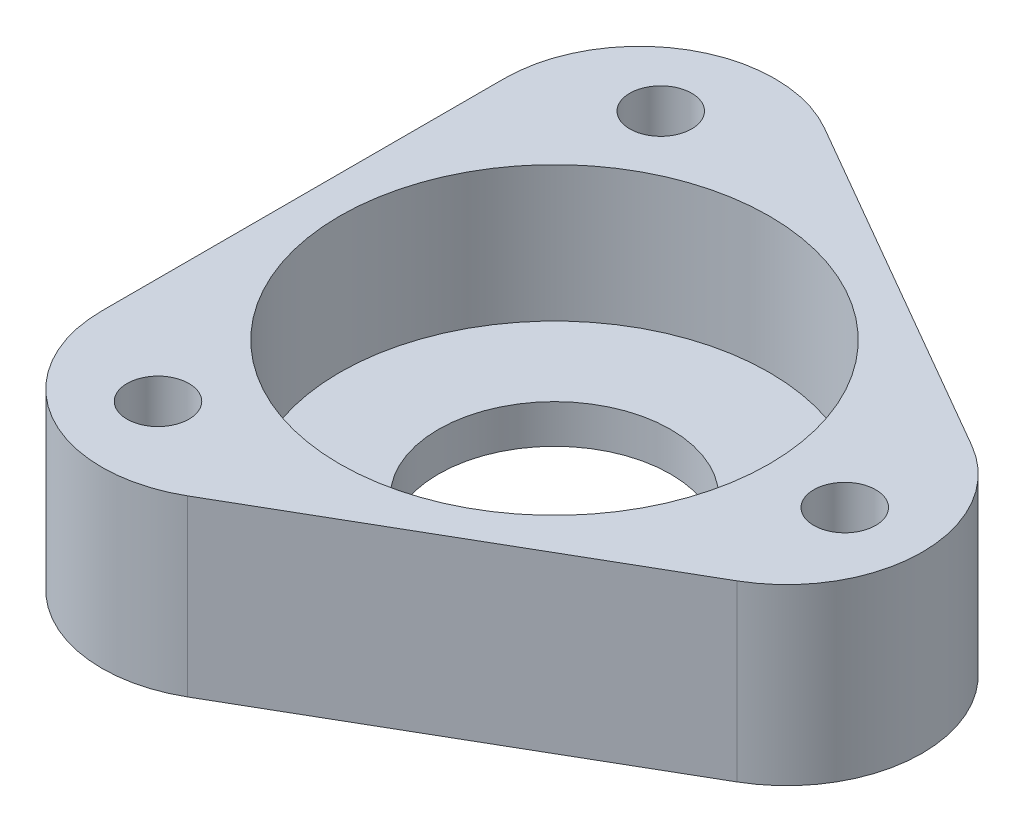
ISO-10303-21;
HEADER;
FILE_DESCRIPTION(('STEP AP214'),'2;1');
FILE_NAME('part.step','',(''),(''),'','','');
FILE_SCHEMA(('AUTOMOTIVE_DESIGN { 1 0 10303 214 1 1 1 1 }'));
ENDSEC;
DATA;
#1=APPLICATION_CONTEXT('core data for automotive mechanical design processes');
#2=APPLICATION_PROTOCOL_DEFINITION('international standard','automotive_design',2000,#1);
#3=PRODUCT_CONTEXT('',#1,'mechanical');
#4=PRODUCT('Part','Part','',(#3));
#5=PRODUCT_RELATED_PRODUCT_CATEGORY('part','',(#4));
#6=PRODUCT_DEFINITION_FORMATION('','',#4);
#7=PRODUCT_DEFINITION_CONTEXT('part definition',#1,'design');
#8=PRODUCT_DEFINITION('design','',#6,#7);
#9=PRODUCT_DEFINITION_SHAPE('','',#8);
#10=(LENGTH_UNIT() NAMED_UNIT(*) SI_UNIT(.MILLI.,.METRE.));
#11=(NAMED_UNIT(*) PLANE_ANGLE_UNIT() SI_UNIT($,.RADIAN.));
#12=(NAMED_UNIT(*) SI_UNIT($,.STERADIAN.) SOLID_ANGLE_UNIT());
#13=UNCERTAINTY_MEASURE_WITH_UNIT(LENGTH_MEASURE(1.E-05),#10,'distance_accuracy_value','');
#14=(GEOMETRIC_REPRESENTATION_CONTEXT(3) GLOBAL_UNCERTAINTY_ASSIGNED_CONTEXT((#13)) GLOBAL_UNIT_ASSIGNED_CONTEXT((#10,
#11,#12)) REPRESENTATION_CONTEXT('',''));
#15=CARTESIAN_POINT('',(0.,0.,0.));
#16=DIRECTION('',(0.,0.,1.));
#17=DIRECTION('',(1.,0.,0.));
#18=AXIS2_PLACEMENT_3D('',#15,#16,#17);
#19=CARTESIAN_POINT('',(0.,8.99999999999995,0.));
#20=DIRECTION('',(0.,1.,0.));
#21=DIRECTION('',(0.,0.,1.));
#22=AXIS2_PLACEMENT_3D('',#19,#20,#21);
#23=PLANE('',#22);
#24=CARTESIAN_POINT('',(0.,8.99999999999995,0.));
#25=DIRECTION('',(0.,1.,0.));
#26=DIRECTION('',(0.,0.,1.));
#27=AXIS2_PLACEMENT_3D('',#24,#25,#26);
#28=CIRCLE('',#27,11.1);
#29=CARTESIAN_POINT('',(0.,8.99999999999995,11.1));
#30=VERTEX_POINT('',#29);
#31=EDGE_CURVE('E175',#30,#30,#28,.T.);
#32=ORIENTED_EDGE('',*,*,#31,.F.);
#33=EDGE_LOOP('',(#32));
#34=FACE_BOUND('',#33,.T.);
#35=CARTESIAN_POINT('',(15.0000000000006,9.00000000000001,-9.57567358739198E-13));
#36=DIRECTION('',(0.,1.,0.));
#37=DIRECTION('',(0.,0.,1.));
#38=AXIS2_PLACEMENT_3D('',#35,#36,#37);
#39=CIRCLE('',#38,1.6);
#40=CARTESIAN_POINT('',(15.0000000000006,9.00000000000001,1.59999999999904));
#41=VERTEX_POINT('',#40);
#42=EDGE_CURVE('E169',#41,#41,#39,.T.);
#43=ORIENTED_EDGE('',*,*,#42,.F.);
#44=EDGE_LOOP('',(#43));
#45=FACE_BOUND('',#44,.T.);
#46=DIRECTION('',(0.866025403784439,0.,-0.5));
#47=VECTOR('',#46,1.);
#48=CARTESIAN_POINT('',(-13.,9.00000000000001,22.5166604983954));
#49=LINE('',#48,#47);
#50=CARTESIAN_POINT('',(-2.50000000000001,9.00000000000006,16.4544826719043));
#51=VERTEX_POINT('',#50);
#52=CARTESIAN_POINT('',(15.5,9.00000000000006,6.06217782649108));
#53=VERTEX_POINT('',#52);
#54=EDGE_CURVE('E120',#51,#53,#49,.T.);
#55=ORIENTED_EDGE('',*,*,#54,.T.);
#56=CARTESIAN_POINT('',(12.,9.00000000000006,0.));
#57=DIRECTION('',(0.,1.,0.));
#58=DIRECTION('',(0.,0.,1.));
#59=AXIS2_PLACEMENT_3D('',#56,#57,#58);
#60=CIRCLE('',#59,7.);
#61=CARTESIAN_POINT('',(15.5,9.00000000000001,-6.06217782649107));
#62=VERTEX_POINT('',#61);
#63=EDGE_CURVE('E136',#53,#62,#60,.T.);
#64=ORIENTED_EDGE('',*,*,#63,.T.);
#65=DIRECTION('',(-0.866025403784439,0.,-0.5));
#66=VECTOR('',#65,1.);
#67=CARTESIAN_POINT('',(26.,9.00000000000006,0.));
#68=LINE('',#67,#66);
#69=CARTESIAN_POINT('',(-2.5,9.00000000000001,-16.4544826719043));
#70=VERTEX_POINT('',#69);
#71=EDGE_CURVE('E110',#62,#70,#68,.T.);
#72=ORIENTED_EDGE('',*,*,#71,.T.);
#73=CARTESIAN_POINT('',(-6.,9.00000000000001,-10.3923048454133));
#74=DIRECTION('',(0.,1.,0.));
#75=DIRECTION('',(0.,0.,1.));
#76=AXIS2_PLACEMENT_3D('',#73,#74,#75);
#77=CIRCLE('',#76,7.);
#78=CARTESIAN_POINT('',(-13.,9.00000000000001,-10.3923048454133));
#79=VERTEX_POINT('',#78);
#80=EDGE_CURVE('E58',#70,#79,#77,.T.);
#81=ORIENTED_EDGE('',*,*,#80,.T.);
#82=DIRECTION('',(0.,0.,1.));
#83=VECTOR('',#82,1.);
#84=CARTESIAN_POINT('',(-13.,9.00000000000001,-22.5166604983954));
#85=LINE('',#84,#83);
#86=CARTESIAN_POINT('',(-13.,9.00000000000012,10.3923048454133));
#87=VERTEX_POINT('',#86);
#88=EDGE_CURVE('E126',#79,#87,#85,.T.);
#89=ORIENTED_EDGE('',*,*,#88,.T.);
#90=CARTESIAN_POINT('',(-6.00000000000001,9.00000000000006,10.3923048454133));
#91=DIRECTION('',(0.,1.,0.));
#92=DIRECTION('',(0.,0.,1.));
#93=AXIS2_PLACEMENT_3D('',#90,#91,#92);
#94=CIRCLE('',#93,7.);
#95=EDGE_CURVE('E134',#87,#51,#94,.T.);
#96=ORIENTED_EDGE('',*,*,#95,.T.);
#97=EDGE_LOOP('',(#55,#64,#72,#81,#89,#96));
#98=FACE_BOUND('',#97,.T.);
#99=CARTESIAN_POINT('',(-7.5,9.00000000000001,-12.9903810567666));
#100=DIRECTION('',(0.,1.,0.));
#101=DIRECTION('',(0.,0.,1.));
#102=AXIS2_PLACEMENT_3D('',#99,#100,#101);
#103=CIRCLE('',#102,1.6);
#104=CARTESIAN_POINT('',(-7.5,9.00000000000001,-11.3903810567666));
#105=VERTEX_POINT('',#104);
#106=EDGE_CURVE('E122',#105,#105,#103,.T.);
#107=ORIENTED_EDGE('',*,*,#106,.F.);
#108=EDGE_LOOP('',(#107));
#109=FACE_BOUND('',#108,.T.);
#110=CARTESIAN_POINT('',(-7.49999999999891,8.99999999999995,12.9903810567666));
#111=DIRECTION('',(0.,1.,0.));
#112=DIRECTION('',(0.,0.,1.));
#113=AXIS2_PLACEMENT_3D('',#110,#111,#112);
#114=CIRCLE('',#113,1.6);
#115=CARTESIAN_POINT('',(-7.49999999999891,8.99999999999995,14.5903810567666));
#116=VERTEX_POINT('',#115);
#117=EDGE_CURVE('E163',#116,#116,#114,.T.);
#118=ORIENTED_EDGE('',*,*,#117,.F.);
#119=EDGE_LOOP('',(#118));
#120=FACE_BOUND('',#119,.T.);
#121=ADVANCED_FACE('F38',(#34,#45,#98,#109,#120),#23,.T.);
#122=CARTESIAN_POINT('',(0.,0.,0.));
#123=DIRECTION('',(0.,1.,0.));
#124=DIRECTION('',(0.,0.,1.));
#125=AXIS2_PLACEMENT_3D('',#122,#123,#124);
#126=PLANE('',#125);
#127=CARTESIAN_POINT('',(0.,0.,0.));
#128=DIRECTION('',(0.,1.,0.));
#129=DIRECTION('',(0.,0.,1.));
#130=AXIS2_PLACEMENT_3D('',#127,#128,#129);
#131=CIRCLE('',#130,6.);
#132=CARTESIAN_POINT('',(0.,0.,6.));
#133=VERTEX_POINT('',#132);
#134=EDGE_CURVE('E285',#133,#133,#131,.T.);
#135=ORIENTED_EDGE('',*,*,#134,.T.);
#136=EDGE_LOOP('',(#135));
#137=FACE_BOUND('',#136,.T.);
#138=DIRECTION('',(-0.866025403784439,0.,-0.5));
#139=VECTOR('',#138,1.);
#140=CARTESIAN_POINT('',(26.,0.,0.));
#141=LINE('',#140,#139);
#142=CARTESIAN_POINT('',(15.5,0.,-6.06217782649107));
#143=VERTEX_POINT('',#142);
#144=CARTESIAN_POINT('',(-2.5,0.,-16.4544826719043));
#145=VERTEX_POINT('',#144);
#146=EDGE_CURVE('E108',#143,#145,#141,.T.);
#147=ORIENTED_EDGE('',*,*,#146,.F.);
#148=CARTESIAN_POINT('',(12.,0.,0.));
#149=DIRECTION('',(0.,1.,0.));
#150=DIRECTION('',(0.,0.,1.));
#151=AXIS2_PLACEMENT_3D('',#148,#149,#150);
#152=CIRCLE('',#151,7.);
#153=CARTESIAN_POINT('',(15.5,0.,6.06217782649108));
#154=VERTEX_POINT('',#153);
#155=EDGE_CURVE('E91',#143,#154,#152,.F.);
#156=ORIENTED_EDGE('',*,*,#155,.T.);
#157=DIRECTION('',(0.866025403784439,0.,-0.5));
#158=VECTOR('',#157,1.);
#159=CARTESIAN_POINT('',(-13.,1.11022302462516E-13,22.5166604983954));
#160=LINE('',#159,#158);
#161=CARTESIAN_POINT('',(-2.50000000000001,0.,16.4544826719043));
#162=VERTEX_POINT('',#161);
#163=EDGE_CURVE('E118',#162,#154,#160,.T.);
#164=ORIENTED_EDGE('',*,*,#163,.F.);
#165=CARTESIAN_POINT('',(-6.,0.,10.3923048454133));
#166=DIRECTION('',(0.,1.,0.));
#167=DIRECTION('',(0.,0.,1.));
#168=AXIS2_PLACEMENT_3D('',#165,#166,#167);
#169=CIRCLE('',#168,7.);
#170=CARTESIAN_POINT('',(-13.,0.,10.3923048454133));
#171=VERTEX_POINT('',#170);
#172=EDGE_CURVE('E102',#162,#171,#169,.F.);
#173=ORIENTED_EDGE('',*,*,#172,.T.);
#174=DIRECTION('',(0.,0.,1.));
#175=VECTOR('',#174,1.);
#176=CARTESIAN_POINT('',(-13.,0.,-22.5166604983954));
#177=LINE('',#176,#175);
#178=CARTESIAN_POINT('',(-13.,0.,-10.3923048454133));
#179=VERTEX_POINT('',#178);
#180=EDGE_CURVE('E117',#179,#171,#177,.T.);
#181=ORIENTED_EDGE('',*,*,#180,.F.);
#182=CARTESIAN_POINT('',(-6.,0.,-10.3923048454133));
#183=DIRECTION('',(0.,1.,0.));
#184=DIRECTION('',(0.,0.,1.));
#185=AXIS2_PLACEMENT_3D('',#182,#183,#184);
#186=CIRCLE('',#185,7.);
#187=EDGE_CURVE('E111',#179,#145,#186,.F.);
#188=ORIENTED_EDGE('',*,*,#187,.T.);
#189=EDGE_LOOP('',(#147,#156,#164,#173,#181,#188));
#190=FACE_BOUND('',#189,.T.);
#191=CARTESIAN_POINT('',(-7.5,0.,-12.9903810567666));
#192=DIRECTION('',(0.,1.,0.));
#193=DIRECTION('',(0.,0.,1.));
#194=AXIS2_PLACEMENT_3D('',#191,#192,#193);
#195=CIRCLE('',#194,1.6);
#196=CARTESIAN_POINT('',(-7.5,0.,-11.3903810567666));
#197=VERTEX_POINT('',#196);
#198=EDGE_CURVE('E152',#197,#197,#195,.T.);
#199=ORIENTED_EDGE('',*,*,#198,.T.);
#200=EDGE_LOOP('',(#199));
#201=FACE_BOUND('',#200,.T.);
#202=CARTESIAN_POINT('',(15.0000000000006,1.11022302462516E-13,-9.57567358739198E-13));
#203=DIRECTION('',(0.,1.,0.));
#204=DIRECTION('',(0.,0.,1.));
#205=AXIS2_PLACEMENT_3D('',#202,#203,#204);
#206=CIRCLE('',#205,1.6);
#207=CARTESIAN_POINT('',(15.0000000000006,1.11016751347393E-13,1.59999999999904));
#208=VERTEX_POINT('',#207);
#209=EDGE_CURVE('E165',#208,#208,#206,.T.);
#210=ORIENTED_EDGE('',*,*,#209,.T.);
#211=EDGE_LOOP('',(#210));
#212=FACE_BOUND('',#211,.T.);
#213=CARTESIAN_POINT('',(-7.49999999999891,0.,12.9903810567666));
#214=DIRECTION('',(0.,1.,0.));
#215=DIRECTION('',(0.,0.,1.));
#216=AXIS2_PLACEMENT_3D('',#213,#214,#215);
#217=CIRCLE('',#216,1.6);
#218=CARTESIAN_POINT('',(-7.49999999999891,0.,14.5903810567666));
#219=VERTEX_POINT('',#218);
#220=EDGE_CURVE('E166',#219,#219,#217,.T.);
#221=ORIENTED_EDGE('',*,*,#220,.T.);
#222=EDGE_LOOP('',(#221));
#223=FACE_BOUND('',#222,.T.);
#224=ADVANCED_FACE('F114',(#137,#190,#201,#212,#223),#126,.F.);
#225=CARTESIAN_POINT('',(-13.,9.00000000000001,22.5166604983954));
#226=DIRECTION('',(-0.5,0.,-0.866025403784439));
#227=DIRECTION('',(-0.866025403784439,0.,0.5));
#228=AXIS2_PLACEMENT_3D('',#225,#226,#227);
#229=PLANE('',#228);
#230=ORIENTED_EDGE('',*,*,#163,.T.);
#231=DIRECTION('',(0.,-1.,0.));
#232=VECTOR('',#231,1.);
#233=CARTESIAN_POINT('',(15.5,9.00000000000006,6.06217782649108));
#234=LINE('',#233,#232);
#235=EDGE_CURVE('E96',#154,#53,#234,.F.);
#236=ORIENTED_EDGE('',*,*,#235,.T.);
#237=ORIENTED_EDGE('',*,*,#54,.F.);
#238=DIRECTION('',(0.,-1.,0.));
#239=VECTOR('',#238,1.);
#240=CARTESIAN_POINT('',(-2.5,9.00000000000006,16.4544826719043));
#241=LINE('',#240,#239);
#242=EDGE_CURVE('E101',#51,#162,#241,.T.);
#243=ORIENTED_EDGE('',*,*,#242,.T.);
#244=EDGE_LOOP('',(#230,#236,#237,#243));
#245=FACE_BOUND('',#244,.T.);
#246=ADVANCED_FACE('F147',(#245),#229,.F.);
#247=CARTESIAN_POINT('',(26.,9.00000000000006,0.));
#248=DIRECTION('',(-0.5,0.,0.866025403784439));
#249=DIRECTION('',(0.866025403784439,0.,0.5));
#250=AXIS2_PLACEMENT_3D('',#247,#248,#249);
#251=PLANE('',#250);
#252=ORIENTED_EDGE('',*,*,#71,.F.);
#253=DIRECTION('',(0.,-1.,0.));
#254=VECTOR('',#253,1.);
#255=CARTESIAN_POINT('',(15.5,9.00000000000001,-6.06217782649107));
#256=LINE('',#255,#254);
#257=EDGE_CURVE('E95',#62,#143,#256,.T.);
#258=ORIENTED_EDGE('',*,*,#257,.T.);
#259=ORIENTED_EDGE('',*,*,#146,.T.);
#260=DIRECTION('',(0.,-1.,0.));
#261=VECTOR('',#260,1.);
#262=CARTESIAN_POINT('',(-2.5,9.00000000000001,-16.4544826719043));
#263=LINE('',#262,#261);
#264=EDGE_CURVE('E112',#145,#70,#263,.F.);
#265=ORIENTED_EDGE('',*,*,#264,.T.);
#266=EDGE_LOOP('',(#252,#258,#259,#265));
#267=FACE_BOUND('',#266,.T.);
#268=ADVANCED_FACE('F107',(#267),#251,.F.);
#269=CARTESIAN_POINT('',(-13.,9.00000000000001,-22.5166604983954));
#270=DIRECTION('',(1.,0.,0.));
#271=DIRECTION('',(0.,0.,-1.));
#272=AXIS2_PLACEMENT_3D('',#269,#270,#271);
#273=PLANE('',#272);
#274=ORIENTED_EDGE('',*,*,#180,.T.);
#275=DIRECTION('',(0.,-1.,0.));
#276=VECTOR('',#275,1.);
#277=CARTESIAN_POINT('',(-13.,9.00000000000012,10.3923048454133));
#278=LINE('',#277,#276);
#279=EDGE_CURVE('E11',#171,#87,#278,.F.);
#280=ORIENTED_EDGE('',*,*,#279,.T.);
#281=ORIENTED_EDGE('',*,*,#88,.F.);
#282=DIRECTION('',(0.,-1.,0.));
#283=VECTOR('',#282,1.);
#284=CARTESIAN_POINT('',(-13.,9.00000000000001,-10.3923048454133));
#285=LINE('',#284,#283);
#286=EDGE_CURVE('E46',#79,#179,#285,.T.);
#287=ORIENTED_EDGE('',*,*,#286,.T.);
#288=EDGE_LOOP('',(#274,#280,#281,#287));
#289=FACE_BOUND('',#288,.T.);
#290=ADVANCED_FACE('F139',(#289),#273,.F.);
#291=CARTESIAN_POINT('',(-7.5,9.00000000000001,-12.9903810567666));
#292=DIRECTION('',(0.,-1.,0.));
#293=DIRECTION('',(0.,0.,-1.));
#294=AXIS2_PLACEMENT_3D('',#291,#292,#293);
#295=CYLINDRICAL_SURFACE('',#294,1.6);
#296=ORIENTED_EDGE('',*,*,#106,.T.);
#297=EDGE_LOOP('',(#296));
#298=FACE_BOUND('',#297,.T.);
#299=ORIENTED_EDGE('',*,*,#198,.F.);
#300=EDGE_LOOP('',(#299));
#301=FACE_BOUND('',#300,.T.);
#302=ADVANCED_FACE('F184',(#298,#301),#295,.F.);
#303=CARTESIAN_POINT('',(15.0000000000006,9.00000000000001,-9.57567358739198E-13));
#304=DIRECTION('',(0.,-1.,0.));
#305=DIRECTION('',(0.,0.,-1.));
#306=AXIS2_PLACEMENT_3D('',#303,#304,#305);
#307=CYLINDRICAL_SURFACE('',#306,1.6);
#308=ORIENTED_EDGE('',*,*,#42,.T.);
#309=EDGE_LOOP('',(#308));
#310=FACE_BOUND('',#309,.T.);
#311=ORIENTED_EDGE('',*,*,#209,.F.);
#312=EDGE_LOOP('',(#311));
#313=FACE_BOUND('',#312,.T.);
#314=ADVANCED_FACE('F186',(#310,#313),#307,.F.);
#315=CARTESIAN_POINT('',(-7.49999999999891,8.99999999999995,12.9903810567666));
#316=DIRECTION('',(0.,-1.,0.));
#317=DIRECTION('',(0.,0.,-1.));
#318=AXIS2_PLACEMENT_3D('',#315,#316,#317);
#319=CYLINDRICAL_SURFACE('',#318,1.6);
#320=ORIENTED_EDGE('',*,*,#117,.T.);
#321=EDGE_LOOP('',(#320));
#322=FACE_BOUND('',#321,.T.);
#323=ORIENTED_EDGE('',*,*,#220,.F.);
#324=EDGE_LOOP('',(#323));
#325=FACE_BOUND('',#324,.T.);
#326=ADVANCED_FACE('F192',(#322,#325),#319,.F.);
#327=CARTESIAN_POINT('',(0.,2.00000000000006,0.));
#328=DIRECTION('',(0.,1.,0.));
#329=DIRECTION('',(0.,0.,1.));
#330=AXIS2_PLACEMENT_3D('',#327,#328,#329);
#331=CYLINDRICAL_SURFACE('',#330,11.1);
#332=CARTESIAN_POINT('',(0.,2.00000000000006,0.));
#333=DIRECTION('',(0.,1.,0.));
#334=DIRECTION('',(0.,0.,1.));
#335=AXIS2_PLACEMENT_3D('',#332,#333,#334);
#336=CIRCLE('',#335,11.1);
#337=CARTESIAN_POINT('',(0.,2.00000000000006,11.1));
#338=VERTEX_POINT('',#337);
#339=EDGE_CURVE('E172',#338,#338,#336,.T.);
#340=ORIENTED_EDGE('',*,*,#339,.F.);
#341=EDGE_LOOP('',(#340));
#342=FACE_BOUND('',#341,.T.);
#343=ORIENTED_EDGE('',*,*,#31,.T.);
#344=EDGE_LOOP('',(#343));
#345=FACE_BOUND('',#344,.T.);
#346=ADVANCED_FACE('F224',(#342,#345),#331,.F.);
#347=CARTESIAN_POINT('',(0.,2.00000000000006,0.));
#348=DIRECTION('',(0.,1.,0.));
#349=DIRECTION('',(0.,0.,1.));
#350=AXIS2_PLACEMENT_3D('',#347,#348,#349);
#351=PLANE('',#350);
#352=CARTESIAN_POINT('',(0.,2.00000000000006,0.));
#353=DIRECTION('',(0.,1.,0.));
#354=DIRECTION('',(0.,0.,1.));
#355=AXIS2_PLACEMENT_3D('',#352,#353,#354);
#356=CIRCLE('',#355,6.);
#357=CARTESIAN_POINT('',(0.,2.00000000000006,6.00000000000001));
#358=VERTEX_POINT('',#357);
#359=EDGE_CURVE('E287',#358,#358,#356,.T.);
#360=ORIENTED_EDGE('',*,*,#359,.F.);
#361=EDGE_LOOP('',(#360));
#362=FACE_BOUND('',#361,.T.);
#363=ORIENTED_EDGE('',*,*,#339,.T.);
#364=EDGE_LOOP('',(#363));
#365=FACE_BOUND('',#364,.T.);
#366=ADVANCED_FACE('F206',(#362,#365),#351,.T.);
#367=CARTESIAN_POINT('',(12.,9.00000000000006,0.));
#368=DIRECTION('',(0.,-1.,0.));
#369=DIRECTION('',(0.,0.,-1.));
#370=AXIS2_PLACEMENT_3D('',#367,#368,#369);
#371=CYLINDRICAL_SURFACE('',#370,7.);
#372=ORIENTED_EDGE('',*,*,#63,.F.);
#373=ORIENTED_EDGE('',*,*,#235,.F.);
#374=ORIENTED_EDGE('',*,*,#155,.F.);
#375=ORIENTED_EDGE('',*,*,#257,.F.);
#376=EDGE_LOOP('',(#372,#373,#374,#375));
#377=FACE_BOUND('',#376,.T.);
#378=ADVANCED_FACE('F94',(#377),#371,.T.);
#379=CARTESIAN_POINT('',(-6.00000000000001,9.00000000000006,10.3923048454133));
#380=DIRECTION('',(0.,-1.,0.));
#381=DIRECTION('',(0.,0.,-1.));
#382=AXIS2_PLACEMENT_3D('',#379,#380,#381);
#383=CYLINDRICAL_SURFACE('',#382,7.);
#384=ORIENTED_EDGE('',*,*,#95,.F.);
#385=ORIENTED_EDGE('',*,*,#279,.F.);
#386=ORIENTED_EDGE('',*,*,#172,.F.);
#387=ORIENTED_EDGE('',*,*,#242,.F.);
#388=EDGE_LOOP('',(#384,#385,#386,#387));
#389=FACE_BOUND('',#388,.T.);
#390=ADVANCED_FACE('F144',(#389),#383,.T.);
#391=CARTESIAN_POINT('',(-6.,9.00000000000001,-10.3923048454133));
#392=DIRECTION('',(0.,-1.,0.));
#393=DIRECTION('',(0.,0.,-1.));
#394=AXIS2_PLACEMENT_3D('',#391,#392,#393);
#395=CYLINDRICAL_SURFACE('',#394,7.);
#396=ORIENTED_EDGE('',*,*,#80,.F.);
#397=ORIENTED_EDGE('',*,*,#264,.F.);
#398=ORIENTED_EDGE('',*,*,#187,.F.);
#399=ORIENTED_EDGE('',*,*,#286,.F.);
#400=EDGE_LOOP('',(#396,#397,#398,#399));
#401=FACE_BOUND('',#400,.T.);
#402=ADVANCED_FACE('F40',(#401),#395,.T.);
#403=CARTESIAN_POINT('',(0.,0.,0.));
#404=DIRECTION('',(0.,1.,0.));
#405=DIRECTION('',(0.,0.,1.));
#406=AXIS2_PLACEMENT_3D('',#403,#404,#405);
#407=CYLINDRICAL_SURFACE('',#406,6.);
#408=ORIENTED_EDGE('',*,*,#134,.F.);
#409=EDGE_LOOP('',(#408));
#410=FACE_BOUND('',#409,.T.);
#411=ORIENTED_EDGE('',*,*,#359,.T.);
#412=EDGE_LOOP('',(#411));
#413=FACE_BOUND('',#412,.T.);
#414=ADVANCED_FACE('F211',(#410,#413),#407,.F.);
#415=CLOSED_SHELL('',(#121,#224,#246,#268,#290,#302,#314,#326,#346,#366,#378,#390,#402,#414));
#416=MANIFOLD_SOLID_BREP('B2',#415);
#417=ADVANCED_BREP_SHAPE_REPRESENTATION('',(#18,#416),#14);
#418=SHAPE_DEFINITION_REPRESENTATION(#9,#417);
ENDSEC;
END-ISO-10303-21;
